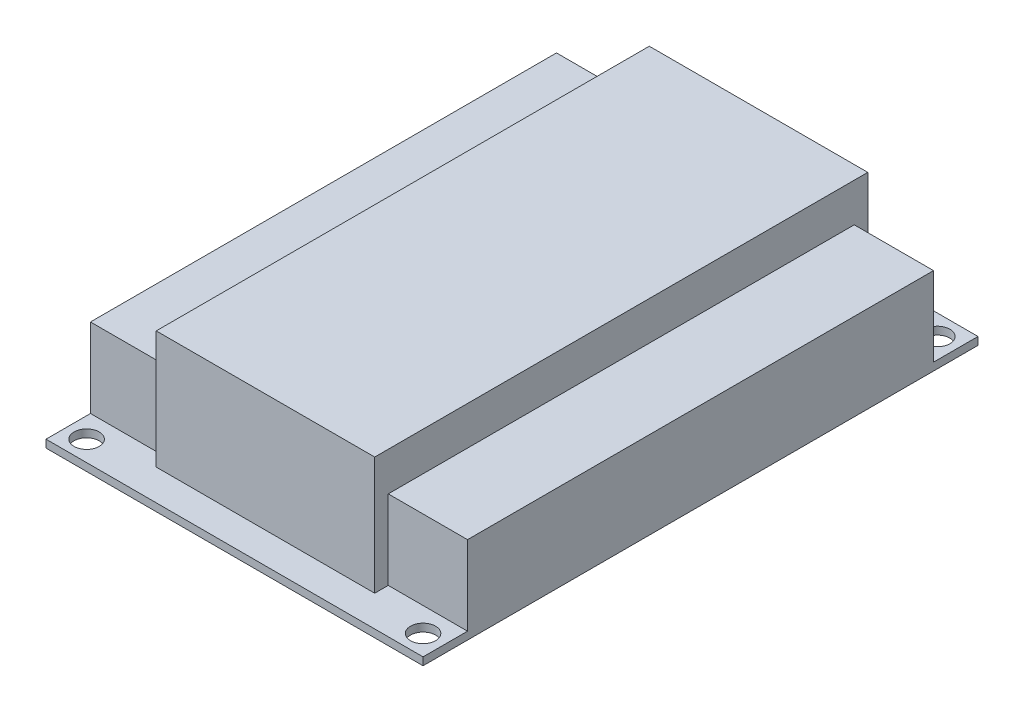
ISO-10303-21;
HEADER;
FILE_DESCRIPTION(('STEP AP214'),'2;1');
FILE_NAME('part.step','',(''),(''),'','','');
FILE_SCHEMA(('AUTOMOTIVE_DESIGN { 1 0 10303 214 1 1 1 1 }'));
ENDSEC;
DATA;
#1=APPLICATION_CONTEXT('core data for automotive mechanical design processes');
#2=APPLICATION_PROTOCOL_DEFINITION('international standard','automotive_design',2000,#1);
#3=PRODUCT_CONTEXT('',#1,'mechanical');
#4=PRODUCT('Part','Part','',(#3));
#5=PRODUCT_RELATED_PRODUCT_CATEGORY('part','',(#4));
#6=PRODUCT_DEFINITION_FORMATION('','',#4);
#7=PRODUCT_DEFINITION_CONTEXT('part definition',#1,'design');
#8=PRODUCT_DEFINITION('design','',#6,#7);
#9=PRODUCT_DEFINITION_SHAPE('','',#8);
#10=(LENGTH_UNIT() NAMED_UNIT(*) SI_UNIT(.MILLI.,.METRE.));
#11=(NAMED_UNIT(*) PLANE_ANGLE_UNIT() SI_UNIT($,.RADIAN.));
#12=(NAMED_UNIT(*) SI_UNIT($,.STERADIAN.) SOLID_ANGLE_UNIT());
#13=UNCERTAINTY_MEASURE_WITH_UNIT(LENGTH_MEASURE(1.E-05),#10,'distance_accuracy_value','');
#14=(GEOMETRIC_REPRESENTATION_CONTEXT(3) GLOBAL_UNCERTAINTY_ASSIGNED_CONTEXT((#13)) GLOBAL_UNIT_ASSIGNED_CONTEXT((#10,
#11,#12)) REPRESENTATION_CONTEXT('',''));
#15=CARTESIAN_POINT('',(0.,0.,0.));
#16=DIRECTION('',(0.,0.,1.));
#17=DIRECTION('',(1.,0.,0.));
#18=AXIS2_PLACEMENT_3D('',#15,#16,#17);
#19=CARTESIAN_POINT('',(-14.9257279783722,16.51,0.));
#20=DIRECTION('',(1.,0.,0.));
#21=DIRECTION('',(0.,0.,-1.));
#22=AXIS2_PLACEMENT_3D('',#19,#20,#21);
#23=PLANE('',#22);
#24=DIRECTION('',(0.,-1.,0.));
#25=VECTOR('',#24,1.);
#26=CARTESIAN_POINT('',(-14.9257279783722,11.43,30.9043352390965));
#27=LINE('',#26,#25);
#28=CARTESIAN_POINT('',(-14.9257279783722,11.43,30.9043352390965));
#29=VERTEX_POINT('',#28);
#30=CARTESIAN_POINT('',(-14.9257279783722,1.016,30.9043352390965));
#31=VERTEX_POINT('',#30);
#32=EDGE_CURVE('E198',#29,#31,#27,.T.);
#33=ORIENTED_EDGE('',*,*,#32,.T.);
#34=DIRECTION('',(0.,0.,1.));
#35=VECTOR('',#34,1.);
#36=CARTESIAN_POINT('',(-14.9257279783722,1.016,0.));
#37=LINE('',#36,#35);
#38=CARTESIAN_POINT('',(-14.9257279783722,1.016,32.6823352390965));
#39=VERTEX_POINT('',#38);
#40=EDGE_CURVE('E332',#31,#39,#37,.T.);
#41=ORIENTED_EDGE('',*,*,#40,.T.);
#42=DIRECTION('',(0.,-1.,0.));
#43=VECTOR('',#42,1.);
#44=CARTESIAN_POINT('',(-14.9257279783722,16.51,32.6823352390965));
#45=LINE('',#44,#43);
#46=CARTESIAN_POINT('',(-14.9257279783722,16.51,32.6823352390965));
#47=VERTEX_POINT('',#46);
#48=EDGE_CURVE('E219',#47,#39,#45,.T.);
#49=ORIENTED_EDGE('',*,*,#48,.F.);
#50=DIRECTION('',(0.,0.,1.));
#51=VECTOR('',#50,1.);
#52=CARTESIAN_POINT('',(-14.9257279783722,16.51,0.));
#53=LINE('',#52,#51);
#54=CARTESIAN_POINT('',(-14.9257279783722,16.51,-32.0876647609035));
#55=VERTEX_POINT('',#54);
#56=EDGE_CURVE('E63',#55,#47,#53,.T.);
#57=ORIENTED_EDGE('',*,*,#56,.F.);
#58=DIRECTION('',(0.,-1.,0.));
#59=VECTOR('',#58,1.);
#60=CARTESIAN_POINT('',(-14.9257279783722,16.51,-32.0876647609035));
#61=LINE('',#60,#59);
#62=CARTESIAN_POINT('',(-14.9257279783722,1.016,-32.0876647609035));
#63=VERTEX_POINT('',#62);
#64=EDGE_CURVE('E51',#55,#63,#61,.T.);
#65=ORIENTED_EDGE('',*,*,#64,.T.);
#66=DIRECTION('',(0.,0.,1.));
#67=VECTOR('',#66,1.);
#68=CARTESIAN_POINT('',(-14.9257279783722,1.016,0.));
#69=LINE('',#68,#67);
#70=CARTESIAN_POINT('',(-14.9257279783722,1.016,-30.3096647609035));
#71=VERTEX_POINT('',#70);
#72=EDGE_CURVE('E225',#63,#71,#69,.T.);
#73=ORIENTED_EDGE('',*,*,#72,.T.);
#74=DIRECTION('',(0.,-1.,0.));
#75=VECTOR('',#74,1.);
#76=CARTESIAN_POINT('',(-14.9257279783722,11.43,-30.3096647609035));
#77=LINE('',#76,#75);
#78=CARTESIAN_POINT('',(-14.9257279783722,11.43,-30.3096647609035));
#79=VERTEX_POINT('',#78);
#80=EDGE_CURVE('E208',#79,#71,#77,.T.);
#81=ORIENTED_EDGE('',*,*,#80,.F.);
#82=DIRECTION('',(0.,0.,1.));
#83=VECTOR('',#82,1.);
#84=CARTESIAN_POINT('',(-14.9257279783722,11.43,0.));
#85=LINE('',#84,#83);
#86=EDGE_CURVE('E184',#79,#29,#85,.T.);
#87=ORIENTED_EDGE('',*,*,#86,.T.);
#88=EDGE_LOOP('',(#33,#41,#49,#57,#65,#73,#81,#87));
#89=FACE_BOUND('',#88,.T.);
#90=ADVANCED_FACE('F43',(#89),#23,.F.);
#91=CARTESIAN_POINT('',(13.7762720216278,16.51,0.));
#92=DIRECTION('',(1.,0.,0.));
#93=DIRECTION('',(0.,0.,-1.));
#94=AXIS2_PLACEMENT_3D('',#91,#92,#93);
#95=PLANE('',#94);
#96=DIRECTION('',(0.,0.,1.));
#97=VECTOR('',#96,1.);
#98=CARTESIAN_POINT('',(13.7762720216278,1.016,0.));
#99=LINE('',#98,#97);
#100=CARTESIAN_POINT('',(13.7762720216278,1.016,30.9043352390965));
#101=VERTEX_POINT('',#100);
#102=CARTESIAN_POINT('',(13.7762720216278,1.016,32.6823352390965));
#103=VERTEX_POINT('',#102);
#104=EDGE_CURVE('E159',#101,#103,#99,.T.);
#105=ORIENTED_EDGE('',*,*,#104,.F.);
#106=DIRECTION('',(0.,-1.,0.));
#107=VECTOR('',#106,1.);
#108=CARTESIAN_POINT('',(13.7762720216278,11.43,30.9043352390965));
#109=LINE('',#108,#107);
#110=CARTESIAN_POINT('',(13.7762720216278,11.43,30.9043352390965));
#111=VERTEX_POINT('',#110);
#112=EDGE_CURVE('E173',#111,#101,#109,.T.);
#113=ORIENTED_EDGE('',*,*,#112,.F.);
#114=DIRECTION('',(0.,0.,1.));
#115=VECTOR('',#114,1.);
#116=CARTESIAN_POINT('',(13.7762720216278,11.43,0.));
#117=LINE('',#116,#115);
#118=CARTESIAN_POINT('',(13.7762720216278,11.43,-30.3096647609035));
#119=VERTEX_POINT('',#118);
#120=EDGE_CURVE('E255',#119,#111,#117,.T.);
#121=ORIENTED_EDGE('',*,*,#120,.F.);
#122=DIRECTION('',(0.,-1.,0.));
#123=VECTOR('',#122,1.);
#124=CARTESIAN_POINT('',(13.7762720216278,11.43,-30.3096647609035));
#125=LINE('',#124,#123);
#126=CARTESIAN_POINT('',(13.7762720216278,1.016,-30.3096647609035));
#127=VERTEX_POINT('',#126);
#128=EDGE_CURVE('E264',#119,#127,#125,.T.);
#129=ORIENTED_EDGE('',*,*,#128,.T.);
#130=DIRECTION('',(0.,0.,1.));
#131=VECTOR('',#130,1.);
#132=CARTESIAN_POINT('',(13.7762720216278,1.016,0.));
#133=LINE('',#132,#131);
#134=CARTESIAN_POINT('',(13.7762720216278,1.016,-32.0876647609035));
#135=VERTEX_POINT('',#134);
#136=EDGE_CURVE('E308',#135,#127,#133,.T.);
#137=ORIENTED_EDGE('',*,*,#136,.F.);
#138=DIRECTION('',(0.,-1.,0.));
#139=VECTOR('',#138,1.);
#140=CARTESIAN_POINT('',(13.7762720216278,16.51,-32.0876647609035));
#141=LINE('',#140,#139);
#142=CARTESIAN_POINT('',(13.7762720216278,16.51,-32.0876647609035));
#143=VERTEX_POINT('',#142);
#144=EDGE_CURVE('E11',#143,#135,#141,.T.);
#145=ORIENTED_EDGE('',*,*,#144,.F.);
#146=DIRECTION('',(0.,0.,1.));
#147=VECTOR('',#146,1.);
#148=CARTESIAN_POINT('',(13.7762720216278,16.51,0.));
#149=LINE('',#148,#147);
#150=CARTESIAN_POINT('',(13.7762720216278,16.51,32.6823352390965));
#151=VERTEX_POINT('',#150);
#152=EDGE_CURVE('E211',#143,#151,#149,.T.);
#153=ORIENTED_EDGE('',*,*,#152,.T.);
#154=DIRECTION('',(0.,-1.,0.));
#155=VECTOR('',#154,1.);
#156=CARTESIAN_POINT('',(13.7762720216278,16.51,32.6823352390965));
#157=LINE('',#156,#155);
#158=EDGE_CURVE('E175',#151,#103,#157,.T.);
#159=ORIENTED_EDGE('',*,*,#158,.T.);
#160=EDGE_LOOP('',(#105,#113,#121,#129,#137,#145,#153,#159));
#161=FACE_BOUND('',#160,.T.);
#162=ADVANCED_FACE('F45',(#161),#95,.T.);
#163=CARTESIAN_POINT('',(0.,16.51,-32.0876647609035));
#164=DIRECTION('',(0.,0.,-1.));
#165=DIRECTION('',(-1.,0.,0.));
#166=AXIS2_PLACEMENT_3D('',#163,#164,#165);
#167=PLANE('',#166);
#168=DIRECTION('',(1.,0.,0.));
#169=VECTOR('',#168,1.);
#170=CARTESIAN_POINT('',(0.,1.016,-32.0876647609035));
#171=LINE('',#170,#169);
#172=EDGE_CURVE('E229',#63,#135,#171,.T.);
#173=ORIENTED_EDGE('',*,*,#172,.F.);
#174=ORIENTED_EDGE('',*,*,#64,.F.);
#175=DIRECTION('',(1.,0.,0.));
#176=VECTOR('',#175,1.);
#177=CARTESIAN_POINT('',(0.,16.51,-32.0876647609035));
#178=LINE('',#177,#176);
#179=EDGE_CURVE('E213',#55,#143,#178,.T.);
#180=ORIENTED_EDGE('',*,*,#179,.T.);
#181=ORIENTED_EDGE('',*,*,#144,.T.);
#182=EDGE_LOOP('',(#173,#174,#180,#181));
#183=FACE_BOUND('',#182,.T.);
#184=ADVANCED_FACE('F228',(#183),#167,.T.);
#185=CARTESIAN_POINT('',(0.,16.51,32.6823352390965));
#186=DIRECTION('',(0.,0.,-1.));
#187=DIRECTION('',(-1.,0.,0.));
#188=AXIS2_PLACEMENT_3D('',#185,#186,#187);
#189=PLANE('',#188);
#190=ORIENTED_EDGE('',*,*,#48,.T.);
#191=DIRECTION('',(1.,0.,0.));
#192=VECTOR('',#191,1.);
#193=CARTESIAN_POINT('',(0.,1.016,32.6823352390965));
#194=LINE('',#193,#192);
#195=EDGE_CURVE('E176',#39,#103,#194,.T.);
#196=ORIENTED_EDGE('',*,*,#195,.T.);
#197=ORIENTED_EDGE('',*,*,#158,.F.);
#198=DIRECTION('',(1.,0.,0.));
#199=VECTOR('',#198,1.);
#200=CARTESIAN_POINT('',(0.,16.51,32.6823352390965));
#201=LINE('',#200,#199);
#202=EDGE_CURVE('E58',#47,#151,#201,.T.);
#203=ORIENTED_EDGE('',*,*,#202,.F.);
#204=EDGE_LOOP('',(#190,#196,#197,#203));
#205=FACE_BOUND('',#204,.T.);
#206=ADVANCED_FACE('F374',(#205),#189,.F.);
#207=CARTESIAN_POINT('',(0.,16.51,0.));
#208=DIRECTION('',(0.,1.,0.));
#209=DIRECTION('',(0.,0.,1.));
#210=AXIS2_PLACEMENT_3D('',#207,#208,#209);
#211=PLANE('',#210);
#212=ORIENTED_EDGE('',*,*,#152,.F.);
#213=ORIENTED_EDGE('',*,*,#179,.F.);
#214=ORIENTED_EDGE('',*,*,#56,.T.);
#215=ORIENTED_EDGE('',*,*,#202,.T.);
#216=EDGE_LOOP('',(#212,#213,#214,#215));
#217=FACE_BOUND('',#216,.T.);
#218=ADVANCED_FACE('F365',(#217),#211,.T.);
#219=CARTESIAN_POINT('',(0.,0.,0.));
#220=DIRECTION('',(0.,1.,0.));
#221=DIRECTION('',(0.,0.,1.));
#222=AXIS2_PLACEMENT_3D('',#219,#220,#221);
#223=PLANE('',#222);
#224=DIRECTION('',(0.,0.,1.));
#225=VECTOR('',#224,1.);
#226=CARTESIAN_POINT('',(-25.3397279783722,0.,0.));
#227=LINE('',#226,#225);
#228=CARTESIAN_POINT('',(-25.3397279783722,0.,-36.1516647609035));
#229=VERTEX_POINT('',#228);
#230=CARTESIAN_POINT('',(-25.3397279783722,0.,36.7463352390965));
#231=VERTEX_POINT('',#230);
#232=EDGE_CURVE('E181',#229,#231,#227,.T.);
#233=ORIENTED_EDGE('',*,*,#232,.F.);
#234=DIRECTION('',(1.,0.,0.));
#235=VECTOR('',#234,1.);
#236=CARTESIAN_POINT('',(0.,0.,-36.1516647609035));
#237=LINE('',#236,#235);
#238=CARTESIAN_POINT('',(24.1902720216278,0.,-36.1516647609035));
#239=VERTEX_POINT('',#238);
#240=EDGE_CURVE('E248',#229,#239,#237,.T.);
#241=ORIENTED_EDGE('',*,*,#240,.T.);
#242=DIRECTION('',(0.,0.,1.));
#243=VECTOR('',#242,1.);
#244=CARTESIAN_POINT('',(24.1902720216278,0.,0.));
#245=LINE('',#244,#243);
#246=CARTESIAN_POINT('',(24.1902720216278,0.,36.7463352390965));
#247=VERTEX_POINT('',#246);
#248=EDGE_CURVE('E254',#239,#247,#245,.T.);
#249=ORIENTED_EDGE('',*,*,#248,.T.);
#250=DIRECTION('',(1.,0.,0.));
#251=VECTOR('',#250,1.);
#252=CARTESIAN_POINT('',(0.,0.,36.7463352390965));
#253=LINE('',#252,#251);
#254=EDGE_CURVE('E298',#231,#247,#253,.T.);
#255=ORIENTED_EDGE('',*,*,#254,.F.);
#256=EDGE_LOOP('',(#233,#241,#249,#255));
#257=FACE_BOUND('',#256,.T.);
#258=CARTESIAN_POINT('',(21.5232720216278,0.,-33.4846647609035));
#259=DIRECTION('',(0.,1.,0.));
#260=DIRECTION('',(0.,0.,1.));
#261=AXIS2_PLACEMENT_3D('',#258,#259,#260);
#262=CIRCLE('',#261,1.651);
#263=CARTESIAN_POINT('',(21.5232720216278,0.,-31.8336647609035));
#264=VERTEX_POINT('',#263);
#265=EDGE_CURVE('E241',#264,#264,#262,.T.);
#266=ORIENTED_EDGE('',*,*,#265,.T.);
#267=EDGE_LOOP('',(#266));
#268=FACE_BOUND('',#267,.T.);
#269=CARTESIAN_POINT('',(-22.6727279783722,0.,-33.4846647609035));
#270=DIRECTION('',(0.,1.,0.));
#271=DIRECTION('',(0.,0.,1.));
#272=AXIS2_PLACEMENT_3D('',#269,#270,#271);
#273=CIRCLE('',#272,1.651);
#274=CARTESIAN_POINT('',(-22.6727279783722,0.,-31.8336647609035));
#275=VERTEX_POINT('',#274);
#276=EDGE_CURVE('E244',#275,#275,#273,.T.);
#277=ORIENTED_EDGE('',*,*,#276,.T.);
#278=EDGE_LOOP('',(#277));
#279=FACE_BOUND('',#278,.T.);
#280=CARTESIAN_POINT('',(-22.6727279783722,0.,34.0793352390965));
#281=DIRECTION('',(0.,1.,0.));
#282=DIRECTION('',(0.,0.,1.));
#283=AXIS2_PLACEMENT_3D('',#280,#281,#282);
#284=CIRCLE('',#283,1.651);
#285=CARTESIAN_POINT('',(-22.6727279783722,0.,35.7303352390965));
#286=VERTEX_POINT('',#285);
#287=EDGE_CURVE('E292',#286,#286,#284,.T.);
#288=ORIENTED_EDGE('',*,*,#287,.T.);
#289=EDGE_LOOP('',(#288));
#290=FACE_BOUND('',#289,.T.);
#291=CARTESIAN_POINT('',(21.5232720216278,0.,34.0793352390965));
#292=DIRECTION('',(0.,1.,0.));
#293=DIRECTION('',(0.,0.,1.));
#294=AXIS2_PLACEMENT_3D('',#291,#292,#293);
#295=CIRCLE('',#294,1.651);
#296=CARTESIAN_POINT('',(21.5232720216278,0.,35.7303352390965));
#297=VERTEX_POINT('',#296);
#298=EDGE_CURVE('E295',#297,#297,#295,.T.);
#299=ORIENTED_EDGE('',*,*,#298,.T.);
#300=EDGE_LOOP('',(#299));
#301=FACE_BOUND('',#300,.T.);
#302=ADVANCED_FACE('F363',(#257,#268,#279,#290,#301),#223,.F.);
#303=CARTESIAN_POINT('',(0.,11.43,-30.3096647609035));
#304=DIRECTION('',(0.,0.,-1.));
#305=DIRECTION('',(-1.,0.,0.));
#306=AXIS2_PLACEMENT_3D('',#303,#304,#305);
#307=PLANE('',#306);
#308=DIRECTION('',(1.,0.,0.));
#309=VECTOR('',#308,1.);
#310=CARTESIAN_POINT('',(0.,1.016,-30.3096647609035));
#311=LINE('',#310,#309);
#312=CARTESIAN_POINT('',(-25.3397279783722,1.016,-30.3096647609035));
#313=VERTEX_POINT('',#312);
#314=EDGE_CURVE('E237',#313,#71,#311,.T.);
#315=ORIENTED_EDGE('',*,*,#314,.F.);
#316=DIRECTION('',(0.,-1.,0.));
#317=VECTOR('',#316,1.);
#318=CARTESIAN_POINT('',(-25.3397279783722,11.43,-30.3096647609035));
#319=LINE('',#318,#317);
#320=CARTESIAN_POINT('',(-25.3397279783722,11.43,-30.3096647609035));
#321=VERTEX_POINT('',#320);
#322=EDGE_CURVE('E205',#321,#313,#319,.T.);
#323=ORIENTED_EDGE('',*,*,#322,.F.);
#324=DIRECTION('',(1.,0.,0.));
#325=VECTOR('',#324,1.);
#326=CARTESIAN_POINT('',(0.,11.43,-30.3096647609035));
#327=LINE('',#326,#325);
#328=EDGE_CURVE('E192',#321,#79,#327,.T.);
#329=ORIENTED_EDGE('',*,*,#328,.T.);
#330=ORIENTED_EDGE('',*,*,#80,.T.);
#331=EDGE_LOOP('',(#315,#323,#329,#330));
#332=FACE_BOUND('',#331,.T.);
#333=ADVANCED_FACE('F321',(#332),#307,.T.);
#334=CARTESIAN_POINT('',(-25.3397279783722,11.43,0.));
#335=DIRECTION('',(1.,0.,0.));
#336=DIRECTION('',(0.,0.,-1.));
#337=AXIS2_PLACEMENT_3D('',#334,#335,#336);
#338=PLANE('',#337);
#339=ORIENTED_EDGE('',*,*,#232,.T.);
#340=DIRECTION('',(0.,-1.,0.));
#341=VECTOR('',#340,1.);
#342=CARTESIAN_POINT('',(-25.3397279783722,1.016,36.7463352390965));
#343=LINE('',#342,#341);
#344=CARTESIAN_POINT('',(-25.3397279783722,1.016,36.7463352390965));
#345=VERTEX_POINT('',#344);
#346=EDGE_CURVE('E245',#345,#231,#343,.T.);
#347=ORIENTED_EDGE('',*,*,#346,.F.);
#348=DIRECTION('',(0.,0.,1.));
#349=VECTOR('',#348,1.);
#350=CARTESIAN_POINT('',(-25.3397279783722,1.016,0.));
#351=LINE('',#350,#349);
#352=CARTESIAN_POINT('',(-25.3397279783722,1.016,30.9043352390965));
#353=VERTEX_POINT('',#352);
#354=EDGE_CURVE('E288',#353,#345,#351,.T.);
#355=ORIENTED_EDGE('',*,*,#354,.F.);
#356=DIRECTION('',(0.,-1.,0.));
#357=VECTOR('',#356,1.);
#358=CARTESIAN_POINT('',(-25.3397279783722,11.43,30.9043352390965));
#359=LINE('',#358,#357);
#360=CARTESIAN_POINT('',(-25.3397279783722,11.43,30.9043352390965));
#361=VERTEX_POINT('',#360);
#362=EDGE_CURVE('E202',#361,#353,#359,.T.);
#363=ORIENTED_EDGE('',*,*,#362,.F.);
#364=DIRECTION('',(0.,0.,1.));
#365=VECTOR('',#364,1.);
#366=CARTESIAN_POINT('',(-25.3397279783722,11.43,0.));
#367=LINE('',#366,#365);
#368=EDGE_CURVE('E195',#321,#361,#367,.T.);
#369=ORIENTED_EDGE('',*,*,#368,.F.);
#370=ORIENTED_EDGE('',*,*,#322,.T.);
#371=DIRECTION('',(0.,0.,1.));
#372=VECTOR('',#371,1.);
#373=CARTESIAN_POINT('',(-25.3397279783722,1.016,0.));
#374=LINE('',#373,#372);
#375=CARTESIAN_POINT('',(-25.3397279783722,1.016,-36.1516647609035));
#376=VERTEX_POINT('',#375);
#377=EDGE_CURVE('E315',#376,#313,#374,.T.);
#378=ORIENTED_EDGE('',*,*,#377,.F.);
#379=DIRECTION('',(0.,-1.,0.));
#380=VECTOR('',#379,1.);
#381=CARTESIAN_POINT('',(-25.3397279783722,1.016,-36.1516647609035));
#382=LINE('',#381,#380);
#383=EDGE_CURVE('E232',#376,#229,#382,.T.);
#384=ORIENTED_EDGE('',*,*,#383,.T.);
#385=EDGE_LOOP('',(#339,#347,#355,#363,#369,#370,#378,#384));
#386=FACE_BOUND('',#385,.T.);
#387=ADVANCED_FACE('F324',(#386),#338,.F.);
#388=CARTESIAN_POINT('',(0.,11.43,30.9043352390965));
#389=DIRECTION('',(0.,0.,-1.));
#390=DIRECTION('',(-1.,0.,0.));
#391=AXIS2_PLACEMENT_3D('',#388,#389,#390);
#392=PLANE('',#391);
#393=ORIENTED_EDGE('',*,*,#362,.T.);
#394=DIRECTION('',(1.,0.,0.));
#395=VECTOR('',#394,1.);
#396=CARTESIAN_POINT('',(0.,1.016,30.9043352390965));
#397=LINE('',#396,#395);
#398=EDGE_CURVE('E337',#353,#31,#397,.T.);
#399=ORIENTED_EDGE('',*,*,#398,.T.);
#400=ORIENTED_EDGE('',*,*,#32,.F.);
#401=DIRECTION('',(1.,0.,0.));
#402=VECTOR('',#401,1.);
#403=CARTESIAN_POINT('',(0.,11.43,30.9043352390965));
#404=LINE('',#403,#402);
#405=EDGE_CURVE('E197',#361,#29,#404,.T.);
#406=ORIENTED_EDGE('',*,*,#405,.F.);
#407=EDGE_LOOP('',(#393,#399,#400,#406));
#408=FACE_BOUND('',#407,.T.);
#409=ADVANCED_FACE('F335',(#408),#392,.F.);
#410=CARTESIAN_POINT('',(0.,11.43,0.));
#411=DIRECTION('',(0.,1.,0.));
#412=DIRECTION('',(0.,0.,1.));
#413=AXIS2_PLACEMENT_3D('',#410,#411,#412);
#414=PLANE('',#413);
#415=ORIENTED_EDGE('',*,*,#86,.F.);
#416=ORIENTED_EDGE('',*,*,#328,.F.);
#417=ORIENTED_EDGE('',*,*,#368,.T.);
#418=ORIENTED_EDGE('',*,*,#405,.T.);
#419=EDGE_LOOP('',(#415,#416,#417,#418));
#420=FACE_BOUND('',#419,.T.);
#421=ADVANCED_FACE('F329',(#420),#414,.T.);
#422=CARTESIAN_POINT('',(0.,11.43,30.9043352390965));
#423=DIRECTION('',(0.,0.,-1.));
#424=DIRECTION('',(-1.,0.,0.));
#425=AXIS2_PLACEMENT_3D('',#422,#423,#424);
#426=PLANE('',#425);
#427=ORIENTED_EDGE('',*,*,#112,.T.);
#428=DIRECTION('',(1.,0.,0.));
#429=VECTOR('',#428,1.);
#430=CARTESIAN_POINT('',(0.,1.016,30.9043352390965));
#431=LINE('',#430,#429);
#432=CARTESIAN_POINT('',(24.1902720216278,1.016,30.9043352390965));
#433=VERTEX_POINT('',#432);
#434=EDGE_CURVE('E156',#101,#433,#431,.T.);
#435=ORIENTED_EDGE('',*,*,#434,.T.);
#436=DIRECTION('',(0.,-1.,0.));
#437=VECTOR('',#436,1.);
#438=CARTESIAN_POINT('',(24.1902720216278,11.43,30.9043352390965));
#439=LINE('',#438,#437);
#440=CARTESIAN_POINT('',(24.1902720216278,11.43,30.9043352390965));
#441=VERTEX_POINT('',#440);
#442=EDGE_CURVE('E182',#441,#433,#439,.T.);
#443=ORIENTED_EDGE('',*,*,#442,.F.);
#444=DIRECTION('',(1.,0.,0.));
#445=VECTOR('',#444,1.);
#446=CARTESIAN_POINT('',(0.,11.43,30.9043352390965));
#447=LINE('',#446,#445);
#448=EDGE_CURVE('E179',#111,#441,#447,.T.);
#449=ORIENTED_EDGE('',*,*,#448,.F.);
#450=EDGE_LOOP('',(#427,#435,#443,#449));
#451=FACE_BOUND('',#450,.T.);
#452=ADVANCED_FACE('F178',(#451),#426,.F.);
#453=CARTESIAN_POINT('',(24.1902720216278,11.43,0.));
#454=DIRECTION('',(1.,0.,0.));
#455=DIRECTION('',(0.,0.,-1.));
#456=AXIS2_PLACEMENT_3D('',#453,#454,#455);
#457=PLANE('',#456);
#458=ORIENTED_EDGE('',*,*,#248,.F.);
#459=DIRECTION('',(0.,-1.,0.));
#460=VECTOR('',#459,1.);
#461=CARTESIAN_POINT('',(24.1902720216278,1.016,-36.1516647609035));
#462=LINE('',#461,#460);
#463=CARTESIAN_POINT('',(24.1902720216278,1.016,-36.1516647609035));
#464=VERTEX_POINT('',#463);
#465=EDGE_CURVE('E235',#464,#239,#462,.T.);
#466=ORIENTED_EDGE('',*,*,#465,.F.);
#467=DIRECTION('',(0.,0.,1.));
#468=VECTOR('',#467,1.);
#469=CARTESIAN_POINT('',(24.1902720216278,1.016,0.));
#470=LINE('',#469,#468);
#471=CARTESIAN_POINT('',(24.1902720216278,1.016,-30.3096647609035));
#472=VERTEX_POINT('',#471);
#473=EDGE_CURVE('E278',#464,#472,#470,.T.);
#474=ORIENTED_EDGE('',*,*,#473,.T.);
#475=DIRECTION('',(0.,-1.,0.));
#476=VECTOR('',#475,1.);
#477=CARTESIAN_POINT('',(24.1902720216278,11.43,-30.3096647609035));
#478=LINE('',#477,#476);
#479=CARTESIAN_POINT('',(24.1902720216278,11.43,-30.3096647609035));
#480=VERTEX_POINT('',#479);
#481=EDGE_CURVE('E186',#480,#472,#478,.T.);
#482=ORIENTED_EDGE('',*,*,#481,.F.);
#483=DIRECTION('',(0.,0.,1.));
#484=VECTOR('',#483,1.);
#485=CARTESIAN_POINT('',(24.1902720216278,11.43,0.));
#486=LINE('',#485,#484);
#487=EDGE_CURVE('E258',#480,#441,#486,.T.);
#488=ORIENTED_EDGE('',*,*,#487,.T.);
#489=ORIENTED_EDGE('',*,*,#442,.T.);
#490=DIRECTION('',(0.,0.,1.));
#491=VECTOR('',#490,1.);
#492=CARTESIAN_POINT('',(24.1902720216278,1.016,0.));
#493=LINE('',#492,#491);
#494=CARTESIAN_POINT('',(24.1902720216278,1.016,36.7463352390965));
#495=VERTEX_POINT('',#494);
#496=EDGE_CURVE('E162',#433,#495,#493,.T.);
#497=ORIENTED_EDGE('',*,*,#496,.T.);
#498=DIRECTION('',(0.,-1.,0.));
#499=VECTOR('',#498,1.);
#500=CARTESIAN_POINT('',(24.1902720216278,1.016,36.7463352390965));
#501=LINE('',#500,#499);
#502=EDGE_CURVE('E283',#495,#247,#501,.T.);
#503=ORIENTED_EDGE('',*,*,#502,.T.);
#504=EDGE_LOOP('',(#458,#466,#474,#482,#488,#489,#497,#503));
#505=FACE_BOUND('',#504,.T.);
#506=ADVANCED_FACE('F276',(#505),#457,.T.);
#507=CARTESIAN_POINT('',(0.,11.43,-30.3096647609035));
#508=DIRECTION('',(0.,0.,-1.));
#509=DIRECTION('',(-1.,0.,0.));
#510=AXIS2_PLACEMENT_3D('',#507,#508,#509);
#511=PLANE('',#510);
#512=DIRECTION('',(1.,0.,0.));
#513=VECTOR('',#512,1.);
#514=CARTESIAN_POINT('',(0.,1.016,-30.3096647609035));
#515=LINE('',#514,#513);
#516=EDGE_CURVE('E271',#127,#472,#515,.T.);
#517=ORIENTED_EDGE('',*,*,#516,.F.);
#518=ORIENTED_EDGE('',*,*,#128,.F.);
#519=DIRECTION('',(1.,0.,0.));
#520=VECTOR('',#519,1.);
#521=CARTESIAN_POINT('',(0.,11.43,-30.3096647609035));
#522=LINE('',#521,#520);
#523=EDGE_CURVE('E261',#119,#480,#522,.T.);
#524=ORIENTED_EDGE('',*,*,#523,.T.);
#525=ORIENTED_EDGE('',*,*,#481,.T.);
#526=EDGE_LOOP('',(#517,#518,#524,#525));
#527=FACE_BOUND('',#526,.T.);
#528=ADVANCED_FACE('F270',(#527),#511,.T.);
#529=CARTESIAN_POINT('',(0.,11.43,0.));
#530=DIRECTION('',(0.,1.,0.));
#531=DIRECTION('',(0.,0.,1.));
#532=AXIS2_PLACEMENT_3D('',#529,#530,#531);
#533=PLANE('',#532);
#534=ORIENTED_EDGE('',*,*,#120,.T.);
#535=ORIENTED_EDGE('',*,*,#448,.T.);
#536=ORIENTED_EDGE('',*,*,#487,.F.);
#537=ORIENTED_EDGE('',*,*,#523,.F.);
#538=EDGE_LOOP('',(#534,#535,#536,#537));
#539=FACE_BOUND('',#538,.T.);
#540=ADVANCED_FACE('F280',(#539),#533,.T.);
#541=CARTESIAN_POINT('',(0.,1.016,-36.1516647609035));
#542=DIRECTION('',(0.,0.,-1.));
#543=DIRECTION('',(-1.,0.,0.));
#544=AXIS2_PLACEMENT_3D('',#541,#542,#543);
#545=PLANE('',#544);
#546=ORIENTED_EDGE('',*,*,#240,.F.);
#547=ORIENTED_EDGE('',*,*,#383,.F.);
#548=DIRECTION('',(1.,0.,0.));
#549=VECTOR('',#548,1.);
#550=CARTESIAN_POINT('',(0.,1.016,-36.1516647609035));
#551=LINE('',#550,#549);
#552=EDGE_CURVE('E312',#376,#464,#551,.T.);
#553=ORIENTED_EDGE('',*,*,#552,.T.);
#554=ORIENTED_EDGE('',*,*,#465,.T.);
#555=EDGE_LOOP('',(#546,#547,#553,#554));
#556=FACE_BOUND('',#555,.T.);
#557=ADVANCED_FACE('F392',(#556),#545,.T.);
#558=CARTESIAN_POINT('',(-22.6727279783722,1.016,-33.4846647609035));
#559=DIRECTION('',(0.,-1.,0.));
#560=DIRECTION('',(0.,0.,-1.));
#561=AXIS2_PLACEMENT_3D('',#558,#559,#560);
#562=CYLINDRICAL_SURFACE('',#561,1.651);
#563=CARTESIAN_POINT('',(-22.6727279783722,1.016,-33.4846647609035));
#564=DIRECTION('',(0.,1.,0.));
#565=DIRECTION('',(0.,0.,1.));
#566=AXIS2_PLACEMENT_3D('',#563,#564,#565);
#567=CIRCLE('',#566,1.651);
#568=CARTESIAN_POINT('',(-22.6727279783722,1.016,-31.8336647609035));
#569=VERTEX_POINT('',#568);
#570=EDGE_CURVE('E305',#569,#569,#567,.T.);
#571=ORIENTED_EDGE('',*,*,#570,.T.);
#572=EDGE_LOOP('',(#571));
#573=FACE_BOUND('',#572,.T.);
#574=ORIENTED_EDGE('',*,*,#276,.F.);
#575=EDGE_LOOP('',(#574));
#576=FACE_BOUND('',#575,.T.);
#577=ADVANCED_FACE('F409',(#573,#576),#562,.F.);
#578=CARTESIAN_POINT('',(21.5232720216278,1.016,-33.4846647609035));
#579=DIRECTION('',(0.,-1.,0.));
#580=DIRECTION('',(0.,0.,-1.));
#581=AXIS2_PLACEMENT_3D('',#578,#579,#580);
#582=CYLINDRICAL_SURFACE('',#581,1.651);
#583=CARTESIAN_POINT('',(21.5232720216278,1.016,-33.4846647609035));
#584=DIRECTION('',(0.,1.,0.));
#585=DIRECTION('',(0.,0.,1.));
#586=AXIS2_PLACEMENT_3D('',#583,#584,#585);
#587=CIRCLE('',#586,1.651);
#588=CARTESIAN_POINT('',(21.5232720216278,1.016,-31.8336647609035));
#589=VERTEX_POINT('',#588);
#590=EDGE_CURVE('E250',#589,#589,#587,.T.);
#591=ORIENTED_EDGE('',*,*,#590,.T.);
#592=EDGE_LOOP('',(#591));
#593=FACE_BOUND('',#592,.T.);
#594=ORIENTED_EDGE('',*,*,#265,.F.);
#595=EDGE_LOOP('',(#594));
#596=FACE_BOUND('',#595,.T.);
#597=ADVANCED_FACE('F401',(#593,#596),#582,.F.);
#598=CARTESIAN_POINT('',(0.,1.016,0.));
#599=DIRECTION('',(0.,1.,0.));
#600=DIRECTION('',(0.,0.,1.));
#601=AXIS2_PLACEMENT_3D('',#598,#599,#600);
#602=PLANE('',#601);
#603=ORIENTED_EDGE('',*,*,#590,.F.);
#604=EDGE_LOOP('',(#603));
#605=FACE_BOUND('',#604,.T.);
#606=ORIENTED_EDGE('',*,*,#570,.F.);
#607=EDGE_LOOP('',(#606));
#608=FACE_BOUND('',#607,.T.);
#609=ORIENTED_EDGE('',*,*,#136,.T.);
#610=ORIENTED_EDGE('',*,*,#516,.T.);
#611=ORIENTED_EDGE('',*,*,#473,.F.);
#612=ORIENTED_EDGE('',*,*,#552,.F.);
#613=ORIENTED_EDGE('',*,*,#377,.T.);
#614=ORIENTED_EDGE('',*,*,#314,.T.);
#615=ORIENTED_EDGE('',*,*,#72,.F.);
#616=ORIENTED_EDGE('',*,*,#172,.T.);
#617=EDGE_LOOP('',(#609,#610,#611,#612,#613,#614,#615,#616));
#618=FACE_BOUND('',#617,.T.);
#619=ADVANCED_FACE('F317',(#605,#608,#618),#602,.T.);
#620=CARTESIAN_POINT('',(0.,1.016,36.7463352390965));
#621=DIRECTION('',(0.,0.,-1.));
#622=DIRECTION('',(-1.,0.,0.));
#623=AXIS2_PLACEMENT_3D('',#620,#621,#622);
#624=PLANE('',#623);
#625=ORIENTED_EDGE('',*,*,#254,.T.);
#626=ORIENTED_EDGE('',*,*,#502,.F.);
#627=DIRECTION('',(1.,0.,0.));
#628=VECTOR('',#627,1.);
#629=CARTESIAN_POINT('',(0.,1.016,36.7463352390965));
#630=LINE('',#629,#628);
#631=EDGE_CURVE('E285',#345,#495,#630,.T.);
#632=ORIENTED_EDGE('',*,*,#631,.F.);
#633=ORIENTED_EDGE('',*,*,#346,.T.);
#634=EDGE_LOOP('',(#625,#626,#632,#633));
#635=FACE_BOUND('',#634,.T.);
#636=ADVANCED_FACE('F359',(#635),#624,.F.);
#637=CARTESIAN_POINT('',(21.5232720216278,1.016,34.0793352390965));
#638=DIRECTION('',(0.,-1.,0.));
#639=DIRECTION('',(0.,0.,-1.));
#640=AXIS2_PLACEMENT_3D('',#637,#638,#639);
#641=CYLINDRICAL_SURFACE('',#640,1.651);
#642=CARTESIAN_POINT('',(21.5232720216278,1.016,34.0793352390965));
#643=DIRECTION('',(0.,1.,0.));
#644=DIRECTION('',(0.,0.,1.));
#645=AXIS2_PLACEMENT_3D('',#642,#643,#644);
#646=CIRCLE('',#645,1.651);
#647=CARTESIAN_POINT('',(21.5232720216278,1.016,35.7303352390965));
#648=VERTEX_POINT('',#647);
#649=EDGE_CURVE('E167',#648,#648,#646,.T.);
#650=ORIENTED_EDGE('',*,*,#649,.T.);
#651=EDGE_LOOP('',(#650));
#652=FACE_BOUND('',#651,.T.);
#653=ORIENTED_EDGE('',*,*,#298,.F.);
#654=EDGE_LOOP('',(#653));
#655=FACE_BOUND('',#654,.T.);
#656=ADVANCED_FACE('F356',(#652,#655),#641,.F.);
#657=CARTESIAN_POINT('',(-22.6727279783722,1.016,34.0793352390965));
#658=DIRECTION('',(0.,-1.,0.));
#659=DIRECTION('',(0.,0.,-1.));
#660=AXIS2_PLACEMENT_3D('',#657,#658,#659);
#661=CYLINDRICAL_SURFACE('',#660,1.651);
#662=CARTESIAN_POINT('',(-22.6727279783722,1.016,34.0793352390965));
#663=DIRECTION('',(0.,1.,0.));
#664=DIRECTION('',(0.,0.,1.));
#665=AXIS2_PLACEMENT_3D('',#662,#663,#664);
#666=CIRCLE('',#665,1.651);
#667=CARTESIAN_POINT('',(-22.6727279783722,1.016,35.7303352390965));
#668=VERTEX_POINT('',#667);
#669=EDGE_CURVE('E299',#668,#668,#666,.T.);
#670=ORIENTED_EDGE('',*,*,#669,.T.);
#671=EDGE_LOOP('',(#670));
#672=FACE_BOUND('',#671,.T.);
#673=ORIENTED_EDGE('',*,*,#287,.F.);
#674=EDGE_LOOP('',(#673));
#675=FACE_BOUND('',#674,.T.);
#676=ADVANCED_FACE('F348',(#672,#675),#661,.F.);
#677=CARTESIAN_POINT('',(0.,1.016,0.));
#678=DIRECTION('',(0.,1.,0.));
#679=DIRECTION('',(0.,0.,1.));
#680=AXIS2_PLACEMENT_3D('',#677,#678,#679);
#681=PLANE('',#680);
#682=ORIENTED_EDGE('',*,*,#669,.F.);
#683=EDGE_LOOP('',(#682));
#684=FACE_BOUND('',#683,.T.);
#685=ORIENTED_EDGE('',*,*,#649,.F.);
#686=EDGE_LOOP('',(#685));
#687=FACE_BOUND('',#686,.T.);
#688=ORIENTED_EDGE('',*,*,#434,.F.);
#689=ORIENTED_EDGE('',*,*,#104,.T.);
#690=ORIENTED_EDGE('',*,*,#195,.F.);
#691=ORIENTED_EDGE('',*,*,#40,.F.);
#692=ORIENTED_EDGE('',*,*,#398,.F.);
#693=ORIENTED_EDGE('',*,*,#354,.T.);
#694=ORIENTED_EDGE('',*,*,#631,.T.);
#695=ORIENTED_EDGE('',*,*,#496,.F.);
#696=EDGE_LOOP('',(#688,#689,#690,#691,#692,#693,#694,#695));
#697=FACE_BOUND('',#696,.T.);
#698=ADVANCED_FACE('F158',(#684,#687,#697),#681,.T.);
#699=CLOSED_SHELL('',(#90,#162,#184,#206,#218,#302,#333,#387,#409,#421,#452,#506,#528,#540,#557,
#577,#597,#619,#636,#656,#676,#698));
#700=MANIFOLD_SOLID_BREP('B2',#699);
#701=ADVANCED_BREP_SHAPE_REPRESENTATION('',(#18,#700),#14);
#702=SHAPE_DEFINITION_REPRESENTATION(#9,#701);
ENDSEC;
END-ISO-10303-21;
